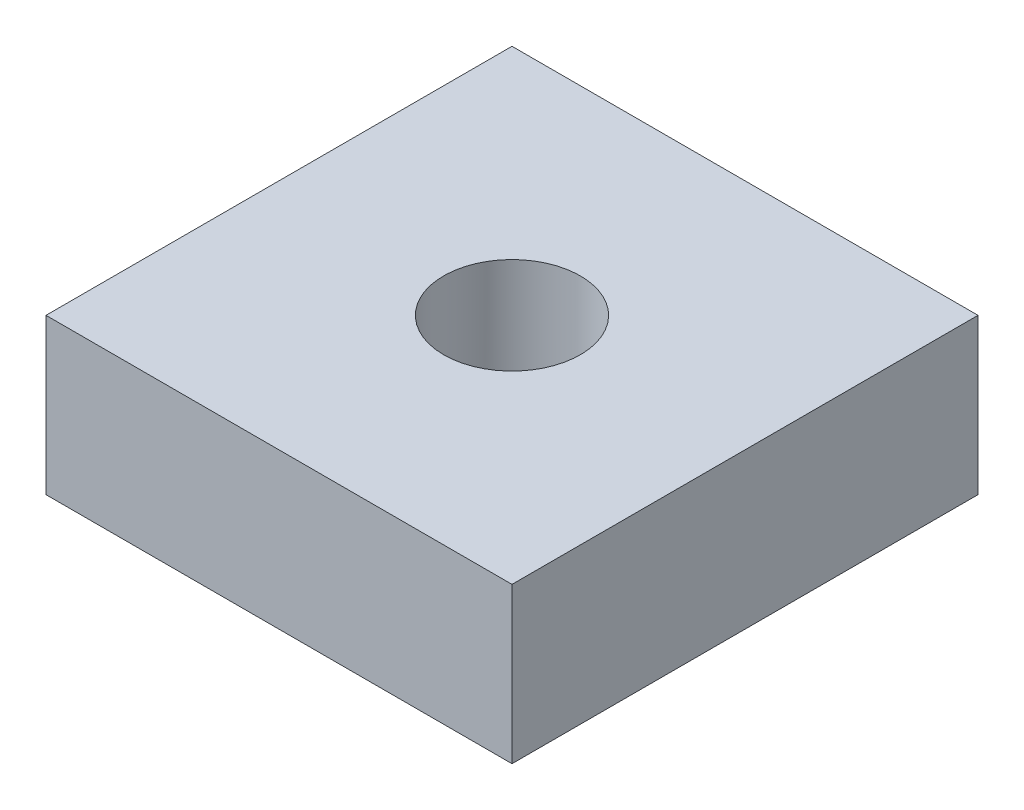
ISO-10303-21;
HEADER;
FILE_DESCRIPTION(('STEP AP214'),'2;1');
FILE_NAME('part.step','',(''),(''),'','','');
FILE_SCHEMA(('AUTOMOTIVE_DESIGN { 1 0 10303 214 1 1 1 1 }'));
ENDSEC;
DATA;
#1=APPLICATION_CONTEXT('core data for automotive mechanical design processes');
#2=APPLICATION_PROTOCOL_DEFINITION('international standard','automotive_design',2000,#1);
#3=PRODUCT_CONTEXT('',#1,'mechanical');
#4=PRODUCT('Part','Part','',(#3));
#5=PRODUCT_RELATED_PRODUCT_CATEGORY('part','',(#4));
#6=PRODUCT_DEFINITION_FORMATION('','',#4);
#7=PRODUCT_DEFINITION_CONTEXT('part definition',#1,'design');
#8=PRODUCT_DEFINITION('design','',#6,#7);
#9=PRODUCT_DEFINITION_SHAPE('','',#8);
#10=(LENGTH_UNIT() NAMED_UNIT(*) SI_UNIT(.MILLI.,.METRE.));
#11=(NAMED_UNIT(*) PLANE_ANGLE_UNIT() SI_UNIT($,.RADIAN.));
#12=(NAMED_UNIT(*) SI_UNIT($,.STERADIAN.) SOLID_ANGLE_UNIT());
#13=UNCERTAINTY_MEASURE_WITH_UNIT(LENGTH_MEASURE(1.E-05),#10,'distance_accuracy_value','');
#14=(GEOMETRIC_REPRESENTATION_CONTEXT(3) GLOBAL_UNCERTAINTY_ASSIGNED_CONTEXT((#13)) GLOBAL_UNIT_ASSIGNED_CONTEXT((#10,
#11,#12)) REPRESENTATION_CONTEXT('',''));
#15=CARTESIAN_POINT('',(0.,0.,0.));
#16=DIRECTION('',(0.,0.,1.));
#17=DIRECTION('',(1.,0.,0.));
#18=AXIS2_PLACEMENT_3D('',#15,#16,#17);
#19=CARTESIAN_POINT('',(19.05,12.7,19.05));
#20=DIRECTION('',(-1.,0.,0.));
#21=DIRECTION('',(0.,0.,1.));
#22=AXIS2_PLACEMENT_3D('',#19,#20,#21);
#23=PLANE('',#22);
#24=DIRECTION('',(0.,0.,-1.));
#25=VECTOR('',#24,1.);
#26=CARTESIAN_POINT('',(19.05,0.,19.05));
#27=LINE('',#26,#25);
#28=CARTESIAN_POINT('',(19.05,0.,19.05));
#29=VERTEX_POINT('',#28);
#30=CARTESIAN_POINT('',(19.05,0.,-19.05));
#31=VERTEX_POINT('',#30);
#32=EDGE_CURVE('E97',#29,#31,#27,.T.);
#33=ORIENTED_EDGE('',*,*,#32,.T.);
#34=DIRECTION('',(0.,-1.,0.));
#35=VECTOR('',#34,1.);
#36=CARTESIAN_POINT('',(19.05,12.7,-19.05));
#37=LINE('',#36,#35);
#38=CARTESIAN_POINT('',(19.05,12.7,-19.05));
#39=VERTEX_POINT('',#38);
#40=EDGE_CURVE('E11',#39,#31,#37,.T.);
#41=ORIENTED_EDGE('',*,*,#40,.F.);
#42=DIRECTION('',(0.,0.,-1.));
#43=VECTOR('',#42,1.);
#44=CARTESIAN_POINT('',(19.05,12.7,19.05));
#45=LINE('',#44,#43);
#46=CARTESIAN_POINT('',(19.05,12.7,19.05));
#47=VERTEX_POINT('',#46);
#48=EDGE_CURVE('E85',#47,#39,#45,.T.);
#49=ORIENTED_EDGE('',*,*,#48,.F.);
#50=DIRECTION('',(0.,-1.,0.));
#51=VECTOR('',#50,1.);
#52=CARTESIAN_POINT('',(19.05,12.7,19.05));
#53=LINE('',#52,#51);
#54=EDGE_CURVE('E93',#47,#29,#53,.T.);
#55=ORIENTED_EDGE('',*,*,#54,.T.);
#56=EDGE_LOOP('',(#33,#41,#49,#55));
#57=FACE_BOUND('',#56,.T.);
#58=ADVANCED_FACE('F34',(#57),#23,.F.);
#59=CARTESIAN_POINT('',(-19.05,12.7,-19.05));
#60=DIRECTION('',(0.,0.,1.));
#61=DIRECTION('',(1.,0.,0.));
#62=AXIS2_PLACEMENT_3D('',#59,#60,#61);
#63=PLANE('',#62);
#64=DIRECTION('',(-1.,0.,0.));
#65=VECTOR('',#64,1.);
#66=CARTESIAN_POINT('',(-19.05,0.,-19.05));
#67=LINE('',#66,#65);
#68=CARTESIAN_POINT('',(-19.05,0.,-19.05));
#69=VERTEX_POINT('',#68);
#70=EDGE_CURVE('E89',#31,#69,#67,.T.);
#71=ORIENTED_EDGE('',*,*,#70,.T.);
#72=DIRECTION('',(0.,-1.,0.));
#73=VECTOR('',#72,1.);
#74=CARTESIAN_POINT('',(-19.05,12.7,-19.05));
#75=LINE('',#74,#73);
#76=CARTESIAN_POINT('',(-19.05,12.7,-19.05));
#77=VERTEX_POINT('',#76);
#78=EDGE_CURVE('E42',#77,#69,#75,.T.);
#79=ORIENTED_EDGE('',*,*,#78,.F.);
#80=DIRECTION('',(-1.,0.,0.));
#81=VECTOR('',#80,1.);
#82=CARTESIAN_POINT('',(-19.05,12.7,-19.05));
#83=LINE('',#82,#81);
#84=EDGE_CURVE('E80',#39,#77,#83,.T.);
#85=ORIENTED_EDGE('',*,*,#84,.F.);
#86=ORIENTED_EDGE('',*,*,#40,.T.);
#87=EDGE_LOOP('',(#71,#79,#85,#86));
#88=FACE_BOUND('',#87,.T.);
#89=ADVANCED_FACE('F88',(#88),#63,.F.);
#90=CARTESIAN_POINT('',(-19.05,12.7,19.05));
#91=DIRECTION('',(1.,0.,0.));
#92=DIRECTION('',(0.,0.,-1.));
#93=AXIS2_PLACEMENT_3D('',#90,#91,#92);
#94=PLANE('',#93);
#95=DIRECTION('',(0.,0.,1.));
#96=VECTOR('',#95,1.);
#97=CARTESIAN_POINT('',(-19.05,0.,19.05));
#98=LINE('',#97,#96);
#99=CARTESIAN_POINT('',(-19.05,0.,19.05));
#100=VERTEX_POINT('',#99);
#101=EDGE_CURVE('E67',#69,#100,#98,.T.);
#102=ORIENTED_EDGE('',*,*,#101,.T.);
#103=DIRECTION('',(0.,-1.,0.));
#104=VECTOR('',#103,1.);
#105=CARTESIAN_POINT('',(-19.05,12.7,19.05));
#106=LINE('',#105,#104);
#107=CARTESIAN_POINT('',(-19.05,12.7,19.05));
#108=VERTEX_POINT('',#107);
#109=EDGE_CURVE('E90',#108,#100,#106,.T.);
#110=ORIENTED_EDGE('',*,*,#109,.F.);
#111=DIRECTION('',(0.,0.,1.));
#112=VECTOR('',#111,1.);
#113=CARTESIAN_POINT('',(-19.05,12.7,19.05));
#114=LINE('',#113,#112);
#115=EDGE_CURVE('E83',#77,#108,#114,.T.);
#116=ORIENTED_EDGE('',*,*,#115,.F.);
#117=ORIENTED_EDGE('',*,*,#78,.T.);
#118=EDGE_LOOP('',(#102,#110,#116,#117));
#119=FACE_BOUND('',#118,.T.);
#120=ADVANCED_FACE('F91',(#119),#94,.F.);
#121=CARTESIAN_POINT('',(-19.05,12.7,19.05));
#122=DIRECTION('',(0.,0.,-1.));
#123=DIRECTION('',(-1.,0.,0.));
#124=AXIS2_PLACEMENT_3D('',#121,#122,#123);
#125=PLANE('',#124);
#126=DIRECTION('',(1.,0.,0.));
#127=VECTOR('',#126,1.);
#128=CARTESIAN_POINT('',(-19.05,0.,19.05));
#129=LINE('',#128,#127);
#130=EDGE_CURVE('E73',#100,#29,#129,.T.);
#131=ORIENTED_EDGE('',*,*,#130,.T.);
#132=ORIENTED_EDGE('',*,*,#54,.F.);
#133=DIRECTION('',(1.,0.,0.));
#134=VECTOR('',#133,1.);
#135=CARTESIAN_POINT('',(-19.05,12.7,19.05));
#136=LINE('',#135,#134);
#137=EDGE_CURVE('E50',#108,#47,#136,.T.);
#138=ORIENTED_EDGE('',*,*,#137,.F.);
#139=ORIENTED_EDGE('',*,*,#109,.T.);
#140=EDGE_LOOP('',(#131,#132,#138,#139));
#141=FACE_BOUND('',#140,.T.);
#142=ADVANCED_FACE('F105',(#141),#125,.F.);
#143=CARTESIAN_POINT('',(0.,12.7,0.));
#144=DIRECTION('',(0.,-1.,0.));
#145=DIRECTION('',(0.,0.,-1.));
#146=AXIS2_PLACEMENT_3D('',#143,#144,#145);
#147=PLANE('',#146);
#148=CARTESIAN_POINT('',(0.,12.7,0.));
#149=DIRECTION('',(0.,1.,0.));
#150=DIRECTION('',(0.,0.,1.));
#151=AXIS2_PLACEMENT_3D('',#148,#149,#150);
#152=CIRCLE('',#151,5.588);
#153=CARTESIAN_POINT('',(0.,12.7,5.588));
#154=VERTEX_POINT('',#153);
#155=EDGE_CURVE('E100',#154,#154,#152,.T.);
#156=ORIENTED_EDGE('',*,*,#155,.F.);
#157=EDGE_LOOP('',(#156));
#158=FACE_BOUND('',#157,.T.);
#159=ORIENTED_EDGE('',*,*,#48,.T.);
#160=ORIENTED_EDGE('',*,*,#84,.T.);
#161=ORIENTED_EDGE('',*,*,#115,.T.);
#162=ORIENTED_EDGE('',*,*,#137,.T.);
#163=EDGE_LOOP('',(#159,#160,#161,#162));
#164=FACE_BOUND('',#163,.T.);
#165=ADVANCED_FACE('F81',(#158,#164),#147,.F.);
#166=CARTESIAN_POINT('',(0.,0.,0.));
#167=DIRECTION('',(0.,-1.,0.));
#168=DIRECTION('',(0.,0.,-1.));
#169=AXIS2_PLACEMENT_3D('',#166,#167,#168);
#170=PLANE('',#169);
#171=CARTESIAN_POINT('',(0.,0.,0.));
#172=DIRECTION('',(0.,-1.,0.));
#173=DIRECTION('',(0.,0.,-1.));
#174=AXIS2_PLACEMENT_3D('',#171,#172,#173);
#175=CIRCLE('',#174,5.588);
#176=CARTESIAN_POINT('',(0.,0.,-5.588));
#177=VERTEX_POINT('',#176);
#178=EDGE_CURVE('E111',#177,#177,#175,.F.);
#179=ORIENTED_EDGE('',*,*,#178,.T.);
#180=EDGE_LOOP('',(#179));
#181=FACE_BOUND('',#180,.T.);
#182=ORIENTED_EDGE('',*,*,#32,.F.);
#183=ORIENTED_EDGE('',*,*,#130,.F.);
#184=ORIENTED_EDGE('',*,*,#101,.F.);
#185=ORIENTED_EDGE('',*,*,#70,.F.);
#186=EDGE_LOOP('',(#182,#183,#184,#185));
#187=FACE_BOUND('',#186,.T.);
#188=ADVANCED_FACE('F108',(#181,#187),#170,.T.);
#189=CARTESIAN_POINT('',(0.,-0.000999999999999265,0.));
#190=DIRECTION('',(0.,1.,0.));
#191=DIRECTION('',(0.,0.,1.));
#192=AXIS2_PLACEMENT_3D('',#189,#190,#191);
#193=CYLINDRICAL_SURFACE('',#192,5.588);
#194=ORIENTED_EDGE('',*,*,#178,.F.);
#195=EDGE_LOOP('',(#194));
#196=FACE_BOUND('',#195,.T.);
#197=ORIENTED_EDGE('',*,*,#155,.T.);
#198=EDGE_LOOP('',(#197));
#199=FACE_BOUND('',#198,.T.);
#200=ADVANCED_FACE('F117',(#196,#199),#193,.F.);
#201=CLOSED_SHELL('',(#58,#89,#120,#142,#165,#188,#200));
#202=MANIFOLD_SOLID_BREP('B2',#201);
#203=ADVANCED_BREP_SHAPE_REPRESENTATION('',(#18,#202),#14);
#204=SHAPE_DEFINITION_REPRESENTATION(#9,#203);
ENDSEC;
END-ISO-10303-21;
